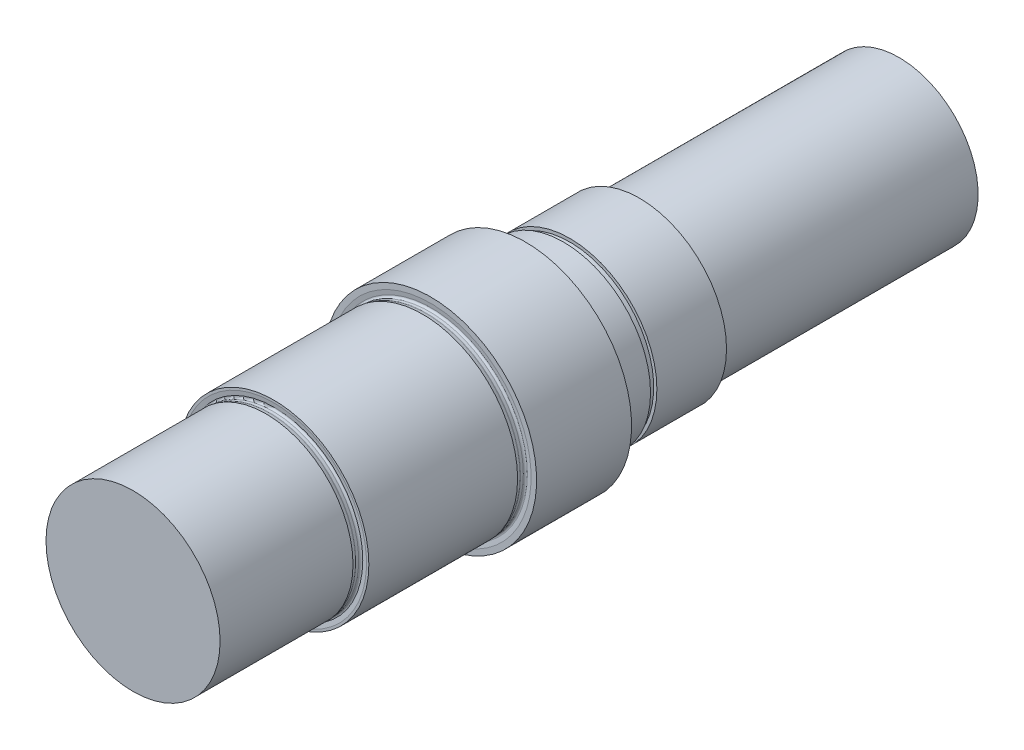
ISO-10303-21;
HEADER;
FILE_DESCRIPTION(('STEP AP214'),'2;1');
FILE_NAME('part.step','',(''),(''),'','','');
FILE_SCHEMA(('AUTOMOTIVE_DESIGN { 1 0 10303 214 1 1 1 1 }'));
ENDSEC;
DATA;
#1=APPLICATION_CONTEXT('core data for automotive mechanical design processes');
#2=APPLICATION_PROTOCOL_DEFINITION('international standard','automotive_design',2000,#1);
#3=PRODUCT_CONTEXT('',#1,'mechanical');
#4=PRODUCT('Part','Part','',(#3));
#5=PRODUCT_RELATED_PRODUCT_CATEGORY('part','',(#4));
#6=PRODUCT_DEFINITION_FORMATION('','',#4);
#7=PRODUCT_DEFINITION_CONTEXT('part definition',#1,'design');
#8=PRODUCT_DEFINITION('design','',#6,#7);
#9=PRODUCT_DEFINITION_SHAPE('','',#8);
#10=(LENGTH_UNIT() NAMED_UNIT(*) SI_UNIT(.MILLI.,.METRE.));
#11=(NAMED_UNIT(*) PLANE_ANGLE_UNIT() SI_UNIT($,.RADIAN.));
#12=(NAMED_UNIT(*) SI_UNIT($,.STERADIAN.) SOLID_ANGLE_UNIT());
#13=UNCERTAINTY_MEASURE_WITH_UNIT(LENGTH_MEASURE(1.E-05),#10,'distance_accuracy_value','');
#14=(GEOMETRIC_REPRESENTATION_CONTEXT(3) GLOBAL_UNCERTAINTY_ASSIGNED_CONTEXT((#13)) GLOBAL_UNIT_ASSIGNED_CONTEXT((#10,
#11,#12)) REPRESENTATION_CONTEXT('',''));
#15=CARTESIAN_POINT('',(0.,0.,0.));
#16=DIRECTION('',(0.,0.,1.));
#17=DIRECTION('',(1.,0.,0.));
#18=AXIS2_PLACEMENT_3D('',#15,#16,#17);
#19=CARTESIAN_POINT('',(0.,0.,-88.99));
#20=DIRECTION('',(0.,0.,-1.));
#21=DIRECTION('',(-1.,0.,0.));
#22=AXIS2_PLACEMENT_3D('',#19,#20,#21);
#23=CYLINDRICAL_SURFACE('',#22,27.5);
#24=CARTESIAN_POINT('',(0.,0.,-136.));
#25=DIRECTION('',(0.,0.,-1.));
#26=DIRECTION('',(-1.,0.,0.));
#27=AXIS2_PLACEMENT_3D('',#24,#25,#26);
#28=CIRCLE('',#27,27.5);
#29=CARTESIAN_POINT('',(-27.5,0.,-136.));
#30=VERTEX_POINT('',#29);
#31=EDGE_CURVE('E134',#30,#30,#28,.T.);
#32=ORIENTED_EDGE('',*,*,#31,.F.);
#33=EDGE_LOOP('',(#32));
#34=FACE_BOUND('',#33,.T.);
#35=CARTESIAN_POINT('',(0.,0.,-126.5));
#36=DIRECTION('',(0.,0.,-1.));
#37=DIRECTION('',(-1.,0.,0.));
#38=AXIS2_PLACEMENT_3D('',#35,#36,#37);
#39=CIRCLE('',#38,27.5);
#40=CARTESIAN_POINT('',(-27.5,0.,-126.5));
#41=VERTEX_POINT('',#40);
#42=EDGE_CURVE('E122',#41,#41,#39,.T.);
#43=ORIENTED_EDGE('',*,*,#42,.T.);
#44=EDGE_LOOP('',(#43));
#45=FACE_BOUND('',#44,.T.);
#46=ADVANCED_FACE('F35',(#34,#45),#23,.T.);
#47=CARTESIAN_POINT('',(0.,30.,-44.5));
#48=DIRECTION('',(0.,0.,1.));
#49=DIRECTION('',(1.,0.,0.));
#50=AXIS2_PLACEMENT_3D('',#47,#48,#49);
#51=PLANE('',#50);
#52=CARTESIAN_POINT('',(0.,0.,-44.5));
#53=DIRECTION('',(0.,0.,-1.));
#54=DIRECTION('',(-1.,0.,0.));
#55=AXIS2_PLACEMENT_3D('',#52,#53,#54);
#56=CIRCLE('',#55,29.2650300316432);
#57=CARTESIAN_POINT('',(-29.2650300316432,0.,-44.5));
#58=VERTEX_POINT('',#57);
#59=EDGE_CURVE('E66',#58,#58,#56,.T.);
#60=ORIENTED_EDGE('',*,*,#59,.T.);
#61=EDGE_LOOP('',(#60));
#62=FACE_BOUND('',#61,.T.);
#63=CARTESIAN_POINT('',(0.,0.,-44.5));
#64=DIRECTION('',(0.,0.,-1.));
#65=DIRECTION('',(-1.,0.,0.));
#66=AXIS2_PLACEMENT_3D('',#63,#64,#65);
#67=CIRCLE('',#66,30.);
#68=CARTESIAN_POINT('',(-30.,0.,-44.5));
#69=VERTEX_POINT('',#68);
#70=EDGE_CURVE('E42',#69,#69,#67,.T.);
#71=ORIENTED_EDGE('',*,*,#70,.F.);
#72=EDGE_LOOP('',(#71));
#73=FACE_BOUND('',#72,.T.);
#74=ADVANCED_FACE('F142',(#62,#73),#51,.T.);
#75=CARTESIAN_POINT('',(0.,0.,-88.99));
#76=DIRECTION('',(0.,0.,-1.));
#77=DIRECTION('',(-1.,0.,0.));
#78=AXIS2_PLACEMENT_3D('',#75,#76,#77);
#79=CYLINDRICAL_SURFACE('',#78,30.);
#80=CARTESIAN_POINT('',(0.,0.,-91.5));
#81=DIRECTION('',(0.,0.,-1.));
#82=DIRECTION('',(-1.,0.,0.));
#83=AXIS2_PLACEMENT_3D('',#80,#81,#82);
#84=CIRCLE('',#83,30.);
#85=CARTESIAN_POINT('',(-30.,0.,-91.5));
#86=VERTEX_POINT('',#85);
#87=EDGE_CURVE('E104',#86,#86,#84,.T.);
#88=ORIENTED_EDGE('',*,*,#87,.F.);
#89=EDGE_LOOP('',(#88));
#90=FACE_BOUND('',#89,.T.);
#91=ORIENTED_EDGE('',*,*,#70,.T.);
#92=EDGE_LOOP('',(#91));
#93=FACE_BOUND('',#92,.T.);
#94=ADVANCED_FACE('F217',(#90,#93),#79,.T.);
#95=CARTESIAN_POINT('',(0.,0.,-44.6941608412449));
#96=DIRECTION('',(0.,0.,1.));
#97=DIRECTION('',(1.,0.,0.));
#98=AXIS2_PLACEMENT_3D('',#95,#96,#97);
#99=CONICAL_SURFACE('',#98,27.883503860576,1.43116998663538);
#100=ORIENTED_EDGE('',*,*,#59,.F.);
#101=EDGE_LOOP('',(#100));
#102=FACE_BOUND('',#101,.T.);
#103=CARTESIAN_POINT('',(0.,0.,-44.6941608412449));
#104=DIRECTION('',(0.,0.,-1.));
#105=DIRECTION('',(-1.,0.,0.));
#106=AXIS2_PLACEMENT_3D('',#103,#104,#105);
#107=CIRCLE('',#106,27.883503860576);
#108=CARTESIAN_POINT('',(-27.883503860576,0.,-44.6941608412449));
#109=VERTEX_POINT('',#108);
#110=EDGE_CURVE('E70',#109,#109,#107,.T.);
#111=ORIENTED_EDGE('',*,*,#110,.T.);
#112=EDGE_LOOP('',(#111));
#113=FACE_BOUND('',#112,.T.);
#114=ADVANCED_FACE('F213',(#102,#113),#99,.F.);
#115=CARTESIAN_POINT('',(0.,0.,-44.1));
#116=DIRECTION('',(0.,0.,-1.));
#117=DIRECTION('',(-1.,0.,0.));
#118=AXIS2_PLACEMENT_3D('',#115,#116,#117);
#119=TOROIDAL_SURFACE('',#118,27.8,0.600000000000002);
#120=ORIENTED_EDGE('',*,*,#110,.F.);
#121=EDGE_LOOP('',(#120));
#122=FACE_BOUND('',#121,.T.);
#123=CARTESIAN_POINT('',(0.,0.,-44.1));
#124=DIRECTION('',(0.,0.,-1.));
#125=DIRECTION('',(-1.,0.,0.));
#126=AXIS2_PLACEMENT_3D('',#123,#124,#125);
#127=CIRCLE('',#126,27.2);
#128=CARTESIAN_POINT('',(-27.2,0.,-44.1));
#129=VERTEX_POINT('',#128);
#130=EDGE_CURVE('E74',#129,#129,#127,.T.);
#131=ORIENTED_EDGE('',*,*,#130,.T.);
#132=EDGE_LOOP('',(#131));
#133=FACE_BOUND('',#132,.T.);
#134=ADVANCED_FACE('F209',(#122,#133),#119,.F.);
#135=CARTESIAN_POINT('',(0.,0.,-88.99));
#136=DIRECTION('',(0.,0.,-1.));
#137=DIRECTION('',(-1.,0.,0.));
#138=AXIS2_PLACEMENT_3D('',#135,#136,#137);
#139=CYLINDRICAL_SURFACE('',#138,27.2);
#140=ORIENTED_EDGE('',*,*,#130,.F.);
#141=EDGE_LOOP('',(#140));
#142=FACE_BOUND('',#141,.T.);
#143=CARTESIAN_POINT('',(0.,0.,-43.1986067408231));
#144=DIRECTION('',(0.,0.,-1.));
#145=DIRECTION('',(-1.,0.,0.));
#146=AXIS2_PLACEMENT_3D('',#143,#144,#145);
#147=CIRCLE('',#146,27.2);
#148=CARTESIAN_POINT('',(-27.2,0.,-43.1986067408231));
#149=VERTEX_POINT('',#148);
#150=EDGE_CURVE('E78',#149,#149,#147,.T.);
#151=ORIENTED_EDGE('',*,*,#150,.T.);
#152=EDGE_LOOP('',(#151));
#153=FACE_BOUND('',#152,.T.);
#154=ADVANCED_FACE('F205',(#142,#153),#139,.T.);
#155=CARTESIAN_POINT('',(0.,0.,-43.1986067408231));
#156=DIRECTION('',(0.,0.,-1.));
#157=DIRECTION('',(-1.,0.,0.));
#158=AXIS2_PLACEMENT_3D('',#155,#156,#157);
#159=TOROIDAL_SURFACE('',#158,27.8,0.600000000000001);
#160=ORIENTED_EDGE('',*,*,#150,.F.);
#161=EDGE_LOOP('',(#160));
#162=FACE_BOUND('',#161,.T.);
#163=CARTESIAN_POINT('',(0.,0.,-43.0433153137616));
#164=DIRECTION('',(0.,0.,-1.));
#165=DIRECTION('',(-1.,0.,0.));
#166=AXIS2_PLACEMENT_3D('',#163,#164,#165);
#167=CIRCLE('',#166,27.2204445042266);
#168=CARTESIAN_POINT('',(-27.2204445042266,0.,-43.0433153137616));
#169=VERTEX_POINT('',#168);
#170=EDGE_CURVE('E82',#169,#169,#167,.T.);
#171=ORIENTED_EDGE('',*,*,#170,.T.);
#172=EDGE_LOOP('',(#171));
#173=FACE_BOUND('',#172,.T.);
#174=ADVANCED_FACE('F201',(#162,#173),#159,.F.);
#175=CARTESIAN_POINT('',(0.,0.,-42.));
#176=DIRECTION('',(0.,0.,1.));
#177=DIRECTION('',(1.,0.,0.));
#178=AXIS2_PLACEMENT_3D('',#175,#176,#177);
#179=CONICAL_SURFACE('',#178,27.5,0.26179938779915);
#180=ORIENTED_EDGE('',*,*,#170,.F.);
#181=EDGE_LOOP('',(#180));
#182=FACE_BOUND('',#181,.T.);
#183=CARTESIAN_POINT('',(0.,0.,-42.));
#184=DIRECTION('',(0.,0.,-1.));
#185=DIRECTION('',(-1.,0.,0.));
#186=AXIS2_PLACEMENT_3D('',#183,#184,#185);
#187=CIRCLE('',#186,27.5);
#188=CARTESIAN_POINT('',(-27.5,0.,-42.));
#189=VERTEX_POINT('',#188);
#190=EDGE_CURVE('E86',#189,#189,#187,.T.);
#191=ORIENTED_EDGE('',*,*,#190,.T.);
#192=EDGE_LOOP('',(#191));
#193=FACE_BOUND('',#192,.T.);
#194=ADVANCED_FACE('F198',(#182,#193),#179,.T.);
#195=CARTESIAN_POINT('',(0.,0.,0.));
#196=DIRECTION('',(0.,0.,1.));
#197=DIRECTION('',(1.,0.,0.));
#198=AXIS2_PLACEMENT_3D('',#195,#196,#197);
#199=PLANE('',#198);
#200=CARTESIAN_POINT('',(0.,0.,0.));
#201=DIRECTION('',(0.,0.,-1.));
#202=DIRECTION('',(-1.,0.,0.));
#203=AXIS2_PLACEMENT_3D('',#200,#201,#202);
#204=CIRCLE('',#203,27.5);
#205=CARTESIAN_POINT('',(-27.5,0.,0.));
#206=VERTEX_POINT('',#205);
#207=EDGE_CURVE('E10',#206,#206,#204,.T.);
#208=ORIENTED_EDGE('',*,*,#207,.F.);
#209=EDGE_LOOP('',(#208));
#210=FACE_BOUND('',#209,.T.);
#211=ADVANCED_FACE('F37',(#210),#199,.T.);
#212=CARTESIAN_POINT('',(0.,0.,-88.99));
#213=DIRECTION('',(0.,0.,-1.));
#214=DIRECTION('',(-1.,0.,0.));
#215=AXIS2_PLACEMENT_3D('',#212,#213,#214);
#216=CYLINDRICAL_SURFACE('',#215,27.5);
#217=ORIENTED_EDGE('',*,*,#190,.F.);
#218=EDGE_LOOP('',(#217));
#219=FACE_BOUND('',#218,.T.);
#220=ORIENTED_EDGE('',*,*,#207,.T.);
#221=EDGE_LOOP('',(#220));
#222=FACE_BOUND('',#221,.T.);
#223=ADVANCED_FACE('F196',(#219,#222),#216,.T.);
#224=CARTESIAN_POINT('',(0.,0.,-94.1941608412449));
#225=DIRECTION('',(0.,0.,1.));
#226=DIRECTION('',(1.,0.,0.));
#227=AXIS2_PLACEMENT_3D('',#224,#225,#226);
#228=CONICAL_SURFACE('',#227,30.383503860576,1.43116998663538);
#229=CARTESIAN_POINT('',(0.,0.,-94.));
#230=DIRECTION('',(0.,0.,-1.));
#231=DIRECTION('',(-1.,0.,0.));
#232=AXIS2_PLACEMENT_3D('',#229,#230,#231);
#233=CIRCLE('',#232,31.7650300316432);
#234=CARTESIAN_POINT('',(-31.7650300316432,0.,-94.));
#235=VERTEX_POINT('',#234);
#236=EDGE_CURVE('E89',#235,#235,#233,.T.);
#237=ORIENTED_EDGE('',*,*,#236,.F.);
#238=EDGE_LOOP('',(#237));
#239=FACE_BOUND('',#238,.T.);
#240=CARTESIAN_POINT('',(0.,0.,-94.1941608412449));
#241=DIRECTION('',(0.,0.,-1.));
#242=DIRECTION('',(-1.,0.,0.));
#243=AXIS2_PLACEMENT_3D('',#240,#241,#242);
#244=CIRCLE('',#243,30.383503860576);
#245=CARTESIAN_POINT('',(-30.383503860576,0.,-94.1941608412449));
#246=VERTEX_POINT('',#245);
#247=EDGE_CURVE('E92',#246,#246,#244,.T.);
#248=ORIENTED_EDGE('',*,*,#247,.T.);
#249=EDGE_LOOP('',(#248));
#250=FACE_BOUND('',#249,.T.);
#251=ADVANCED_FACE('F192',(#239,#250),#228,.F.);
#252=CARTESIAN_POINT('',(0.,0.,-93.6));
#253=DIRECTION('',(0.,0.,-1.));
#254=DIRECTION('',(-1.,0.,0.));
#255=AXIS2_PLACEMENT_3D('',#252,#253,#254);
#256=TOROIDAL_SURFACE('',#255,30.3,0.599999999999998);
#257=ORIENTED_EDGE('',*,*,#247,.F.);
#258=EDGE_LOOP('',(#257));
#259=FACE_BOUND('',#258,.T.);
#260=CARTESIAN_POINT('',(0.,0.,-93.6));
#261=DIRECTION('',(0.,0.,-1.));
#262=DIRECTION('',(-1.,0.,0.));
#263=AXIS2_PLACEMENT_3D('',#260,#261,#262);
#264=CIRCLE('',#263,29.7);
#265=CARTESIAN_POINT('',(-29.7,0.,-93.6));
#266=VERTEX_POINT('',#265);
#267=EDGE_CURVE('E95',#266,#266,#264,.T.);
#268=ORIENTED_EDGE('',*,*,#267,.T.);
#269=EDGE_LOOP('',(#268));
#270=FACE_BOUND('',#269,.T.);
#271=ADVANCED_FACE('F188',(#259,#270),#256,.F.);
#272=CARTESIAN_POINT('',(0.,0.,-88.99));
#273=DIRECTION('',(0.,0.,-1.));
#274=DIRECTION('',(-1.,0.,0.));
#275=AXIS2_PLACEMENT_3D('',#272,#273,#274);
#276=CYLINDRICAL_SURFACE('',#275,29.7);
#277=ORIENTED_EDGE('',*,*,#267,.F.);
#278=EDGE_LOOP('',(#277));
#279=FACE_BOUND('',#278,.T.);
#280=CARTESIAN_POINT('',(0.,0.,-92.6986067408231));
#281=DIRECTION('',(0.,0.,-1.));
#282=DIRECTION('',(-1.,0.,0.));
#283=AXIS2_PLACEMENT_3D('',#280,#281,#282);
#284=CIRCLE('',#283,29.7);
#285=CARTESIAN_POINT('',(-29.7,0.,-92.6986067408231));
#286=VERTEX_POINT('',#285);
#287=EDGE_CURVE('E98',#286,#286,#284,.T.);
#288=ORIENTED_EDGE('',*,*,#287,.T.);
#289=EDGE_LOOP('',(#288));
#290=FACE_BOUND('',#289,.T.);
#291=ADVANCED_FACE('F184',(#279,#290),#276,.T.);
#292=CARTESIAN_POINT('',(0.,0.,-92.6986067408231));
#293=DIRECTION('',(0.,0.,-1.));
#294=DIRECTION('',(-1.,0.,0.));
#295=AXIS2_PLACEMENT_3D('',#292,#293,#294);
#296=TOROIDAL_SURFACE('',#295,30.3,0.599999999999999);
#297=ORIENTED_EDGE('',*,*,#287,.F.);
#298=EDGE_LOOP('',(#297));
#299=FACE_BOUND('',#298,.T.);
#300=CARTESIAN_POINT('',(0.,0.,-92.5433153137616));
#301=DIRECTION('',(0.,0.,-1.));
#302=DIRECTION('',(-1.,0.,0.));
#303=AXIS2_PLACEMENT_3D('',#300,#301,#302);
#304=CIRCLE('',#303,29.7204445042266);
#305=CARTESIAN_POINT('',(-29.7204445042266,0.,-92.5433153137616));
#306=VERTEX_POINT('',#305);
#307=EDGE_CURVE('E101',#306,#306,#304,.T.);
#308=ORIENTED_EDGE('',*,*,#307,.T.);
#309=EDGE_LOOP('',(#308));
#310=FACE_BOUND('',#309,.T.);
#311=ADVANCED_FACE('F180',(#299,#310),#296,.F.);
#312=CARTESIAN_POINT('',(0.,0.,-91.5));
#313=DIRECTION('',(0.,0.,1.));
#314=DIRECTION('',(1.,0.,0.));
#315=AXIS2_PLACEMENT_3D('',#312,#313,#314);
#316=CONICAL_SURFACE('',#315,30.,0.261799387799149);
#317=ORIENTED_EDGE('',*,*,#307,.F.);
#318=EDGE_LOOP('',(#317));
#319=FACE_BOUND('',#318,.T.);
#320=ORIENTED_EDGE('',*,*,#87,.T.);
#321=EDGE_LOOP('',(#320));
#322=FACE_BOUND('',#321,.T.);
#323=ADVANCED_FACE('F176',(#319,#322),#316,.T.);
#324=CARTESIAN_POINT('',(0.,33.5,-124.));
#325=DIRECTION('',(0.,0.,-1.));
#326=DIRECTION('',(-1.,0.,0.));
#327=AXIS2_PLACEMENT_3D('',#324,#325,#326);
#328=PLANE('',#327);
#329=CARTESIAN_POINT('',(0.,0.,-124.));
#330=DIRECTION('',(0.,0.,-1.));
#331=DIRECTION('',(-1.,0.,0.));
#332=AXIS2_PLACEMENT_3D('',#329,#330,#331);
#333=CIRCLE('',#332,29.2650300316432);
#334=CARTESIAN_POINT('',(-29.2650300316432,0.,-124.));
#335=VERTEX_POINT('',#334);
#336=EDGE_CURVE('E107',#335,#335,#333,.T.);
#337=ORIENTED_EDGE('',*,*,#336,.F.);
#338=EDGE_LOOP('',(#337));
#339=FACE_BOUND('',#338,.T.);
#340=CARTESIAN_POINT('',(0.,0.,-124.));
#341=DIRECTION('',(0.,0.,-1.));
#342=DIRECTION('',(-1.,0.,0.));
#343=AXIS2_PLACEMENT_3D('',#340,#341,#342);
#344=CIRCLE('',#343,33.5);
#345=CARTESIAN_POINT('',(-33.5,0.,-124.));
#346=VERTEX_POINT('',#345);
#347=EDGE_CURVE('E52',#346,#346,#344,.T.);
#348=ORIENTED_EDGE('',*,*,#347,.T.);
#349=EDGE_LOOP('',(#348));
#350=FACE_BOUND('',#349,.T.);
#351=ADVANCED_FACE('F179',(#339,#350),#328,.T.);
#352=CARTESIAN_POINT('',(0.,0.,-88.99));
#353=DIRECTION('',(0.,0.,-1.));
#354=DIRECTION('',(-1.,0.,0.));
#355=AXIS2_PLACEMENT_3D('',#352,#353,#354);
#356=CYLINDRICAL_SURFACE('',#355,33.5);
#357=CARTESIAN_POINT('',(0.,0.,-94.));
#358=DIRECTION('',(0.,0.,-1.));
#359=DIRECTION('',(-1.,0.,0.));
#360=AXIS2_PLACEMENT_3D('',#357,#358,#359);
#361=CIRCLE('',#360,33.5);
#362=CARTESIAN_POINT('',(-33.5,0.,-94.));
#363=VERTEX_POINT('',#362);
#364=EDGE_CURVE('E47',#363,#363,#361,.T.);
#365=ORIENTED_EDGE('',*,*,#364,.T.);
#366=EDGE_LOOP('',(#365));
#367=FACE_BOUND('',#366,.T.);
#368=ORIENTED_EDGE('',*,*,#347,.F.);
#369=EDGE_LOOP('',(#368));
#370=FACE_BOUND('',#369,.T.);
#371=ADVANCED_FACE('F236',(#367,#370),#356,.T.);
#372=CARTESIAN_POINT('',(0.,30.,-94.));
#373=DIRECTION('',(0.,0.,1.));
#374=DIRECTION('',(1.,0.,0.));
#375=AXIS2_PLACEMENT_3D('',#372,#373,#374);
#376=PLANE('',#375);
#377=ORIENTED_EDGE('',*,*,#236,.T.);
#378=EDGE_LOOP('',(#377));
#379=FACE_BOUND('',#378,.T.);
#380=ORIENTED_EDGE('',*,*,#364,.F.);
#381=EDGE_LOOP('',(#380));
#382=FACE_BOUND('',#381,.T.);
#383=ADVANCED_FACE('F174',(#379,#382),#376,.T.);
#384=CARTESIAN_POINT('',(0.,0.,-123.805839158755));
#385=DIRECTION('',(0.,0.,-1.));
#386=DIRECTION('',(-1.,0.,0.));
#387=AXIS2_PLACEMENT_3D('',#384,#385,#386);
#388=CONICAL_SURFACE('',#387,27.883503860576,1.43116998663538);
#389=ORIENTED_EDGE('',*,*,#336,.T.);
#390=EDGE_LOOP('',(#389));
#391=FACE_BOUND('',#390,.T.);
#392=CARTESIAN_POINT('',(0.,0.,-123.805839158755));
#393=DIRECTION('',(0.,0.,-1.));
#394=DIRECTION('',(-1.,0.,0.));
#395=AXIS2_PLACEMENT_3D('',#392,#393,#394);
#396=CIRCLE('',#395,27.883503860576);
#397=CARTESIAN_POINT('',(-27.883503860576,0.,-123.805839158755));
#398=VERTEX_POINT('',#397);
#399=EDGE_CURVE('E110',#398,#398,#396,.T.);
#400=ORIENTED_EDGE('',*,*,#399,.F.);
#401=EDGE_LOOP('',(#400));
#402=FACE_BOUND('',#401,.T.);
#403=ADVANCED_FACE('F170',(#391,#402),#388,.F.);
#404=CARTESIAN_POINT('',(0.,0.,-124.4));
#405=DIRECTION('',(0.,0.,-1.));
#406=DIRECTION('',(-1.,0.,0.));
#407=AXIS2_PLACEMENT_3D('',#404,#405,#406);
#408=TOROIDAL_SURFACE('',#407,27.8,0.599999999999998);
#409=ORIENTED_EDGE('',*,*,#399,.T.);
#410=EDGE_LOOP('',(#409));
#411=FACE_BOUND('',#410,.T.);
#412=CARTESIAN_POINT('',(0.,0.,-124.4));
#413=DIRECTION('',(0.,0.,-1.));
#414=DIRECTION('',(-1.,0.,0.));
#415=AXIS2_PLACEMENT_3D('',#412,#413,#414);
#416=CIRCLE('',#415,27.2);
#417=CARTESIAN_POINT('',(-27.2,0.,-124.4));
#418=VERTEX_POINT('',#417);
#419=EDGE_CURVE('E113',#418,#418,#416,.T.);
#420=ORIENTED_EDGE('',*,*,#419,.F.);
#421=EDGE_LOOP('',(#420));
#422=FACE_BOUND('',#421,.T.);
#423=ADVANCED_FACE('F166',(#411,#422),#408,.F.);
#424=CARTESIAN_POINT('',(0.,0.,-88.99));
#425=DIRECTION('',(0.,0.,-1.));
#426=DIRECTION('',(-1.,0.,0.));
#427=AXIS2_PLACEMENT_3D('',#424,#425,#426);
#428=CYLINDRICAL_SURFACE('',#427,27.2);
#429=ORIENTED_EDGE('',*,*,#419,.T.);
#430=EDGE_LOOP('',(#429));
#431=FACE_BOUND('',#430,.T.);
#432=CARTESIAN_POINT('',(0.,0.,-125.301393259177));
#433=DIRECTION('',(0.,0.,-1.));
#434=DIRECTION('',(-1.,0.,0.));
#435=AXIS2_PLACEMENT_3D('',#432,#433,#434);
#436=CIRCLE('',#435,27.2);
#437=CARTESIAN_POINT('',(-27.2,0.,-125.301393259177));
#438=VERTEX_POINT('',#437);
#439=EDGE_CURVE('E116',#438,#438,#436,.T.);
#440=ORIENTED_EDGE('',*,*,#439,.F.);
#441=EDGE_LOOP('',(#440));
#442=FACE_BOUND('',#441,.T.);
#443=ADVANCED_FACE('F159',(#431,#442),#428,.T.);
#444=CARTESIAN_POINT('',(0.,0.,-125.301393259177));
#445=DIRECTION('',(0.,0.,-1.));
#446=DIRECTION('',(-1.,0.,0.));
#447=AXIS2_PLACEMENT_3D('',#444,#445,#446);
#448=TOROIDAL_SURFACE('',#447,27.8,0.599999999999999);
#449=ORIENTED_EDGE('',*,*,#439,.T.);
#450=EDGE_LOOP('',(#449));
#451=FACE_BOUND('',#450,.T.);
#452=CARTESIAN_POINT('',(0.,0.,-125.456684686238));
#453=DIRECTION('',(0.,0.,-1.));
#454=DIRECTION('',(-1.,0.,0.));
#455=AXIS2_PLACEMENT_3D('',#452,#453,#454);
#456=CIRCLE('',#455,27.2204445042266);
#457=CARTESIAN_POINT('',(-27.2204445042266,0.,-125.456684686238));
#458=VERTEX_POINT('',#457);
#459=EDGE_CURVE('E119',#458,#458,#456,.T.);
#460=ORIENTED_EDGE('',*,*,#459,.F.);
#461=EDGE_LOOP('',(#460));
#462=FACE_BOUND('',#461,.T.);
#463=ADVANCED_FACE('F149',(#451,#462),#448,.F.);
#464=CARTESIAN_POINT('',(0.,0.,-126.5));
#465=DIRECTION('',(0.,0.,-1.));
#466=DIRECTION('',(-1.,0.,0.));
#467=AXIS2_PLACEMENT_3D('',#464,#465,#466);
#468=CONICAL_SURFACE('',#467,27.5,0.261799387799149);
#469=ORIENTED_EDGE('',*,*,#459,.T.);
#470=EDGE_LOOP('',(#469));
#471=FACE_BOUND('',#470,.T.);
#472=ORIENTED_EDGE('',*,*,#42,.F.);
#473=EDGE_LOOP('',(#472));
#474=FACE_BOUND('',#473,.T.);
#475=ADVANCED_FACE('F147',(#471,#474),#468,.T.);
#476=CARTESIAN_POINT('',(0.,27.5,-136.));
#477=DIRECTION('',(0.,0.,1.));
#478=DIRECTION('',(1.,0.,0.));
#479=AXIS2_PLACEMENT_3D('',#476,#477,#478);
#480=PLANE('',#479);
#481=CARTESIAN_POINT('',(0.,0.,-136.));
#482=DIRECTION('',(0.,0.,-1.));
#483=DIRECTION('',(-1.,0.,0.));
#484=AXIS2_PLACEMENT_3D('',#481,#482,#483);
#485=CIRCLE('',#484,26.5);
#486=CARTESIAN_POINT('',(-26.5,0.,-136.));
#487=VERTEX_POINT('',#486);
#488=EDGE_CURVE('E125',#487,#487,#485,.T.);
#489=ORIENTED_EDGE('',*,*,#488,.F.);
#490=EDGE_LOOP('',(#489));
#491=FACE_BOUND('',#490,.T.);
#492=ORIENTED_EDGE('',*,*,#31,.T.);
#493=EDGE_LOOP('',(#492));
#494=FACE_BOUND('',#493,.T.);
#495=ADVANCED_FACE('F138',(#491,#494),#480,.F.);
#496=CARTESIAN_POINT('',(0.,0.,-88.99));
#497=DIRECTION('',(0.,0.,-1.));
#498=DIRECTION('',(-1.,0.,0.));
#499=AXIS2_PLACEMENT_3D('',#496,#497,#498);
#500=CYLINDRICAL_SURFACE('',#499,26.5);
#501=CARTESIAN_POINT('',(0.,0.,-138.));
#502=DIRECTION('',(0.,0.,-1.));
#503=DIRECTION('',(-1.,0.,0.));
#504=AXIS2_PLACEMENT_3D('',#501,#502,#503);
#505=CIRCLE('',#504,26.5);
#506=CARTESIAN_POINT('',(-26.5,0.,-138.));
#507=VERTEX_POINT('',#506);
#508=EDGE_CURVE('E128',#507,#507,#505,.T.);
#509=ORIENTED_EDGE('',*,*,#508,.F.);
#510=EDGE_LOOP('',(#509));
#511=FACE_BOUND('',#510,.T.);
#512=ORIENTED_EDGE('',*,*,#488,.T.);
#513=EDGE_LOOP('',(#512));
#514=FACE_BOUND('',#513,.T.);
#515=ADVANCED_FACE('F156',(#511,#514),#500,.T.);
#516=CARTESIAN_POINT('',(0.,27.5,-138.));
#517=DIRECTION('',(0.,0.,-1.));
#518=DIRECTION('',(-1.,0.,0.));
#519=AXIS2_PLACEMENT_3D('',#516,#517,#518);
#520=PLANE('',#519);
#521=CARTESIAN_POINT('',(0.,0.,-138.));
#522=DIRECTION('',(0.,0.,-1.));
#523=DIRECTION('',(-1.,0.,0.));
#524=AXIS2_PLACEMENT_3D('',#521,#522,#523);
#525=CIRCLE('',#524,27.5);
#526=CARTESIAN_POINT('',(-27.5,0.,-138.));
#527=VERTEX_POINT('',#526);
#528=EDGE_CURVE('E131',#527,#527,#525,.T.);
#529=ORIENTED_EDGE('',*,*,#528,.F.);
#530=EDGE_LOOP('',(#529));
#531=FACE_BOUND('',#530,.T.);
#532=ORIENTED_EDGE('',*,*,#508,.T.);
#533=EDGE_LOOP('',(#532));
#534=FACE_BOUND('',#533,.T.);
#535=ADVANCED_FACE('F223',(#531,#534),#520,.F.);
#536=CARTESIAN_POINT('',(0.,25.,-242.));
#537=DIRECTION('',(0.,0.,-1.));
#538=DIRECTION('',(-1.,0.,0.));
#539=AXIS2_PLACEMENT_3D('',#536,#537,#538);
#540=PLANE('',#539);
#541=CARTESIAN_POINT('',(0.,0.,-242.));
#542=DIRECTION('',(0.,0.,-1.));
#543=DIRECTION('',(-1.,0.,0.));
#544=AXIS2_PLACEMENT_3D('',#541,#542,#543);
#545=CIRCLE('',#544,25.);
#546=CARTESIAN_POINT('',(-25.,0.,-242.));
#547=VERTEX_POINT('',#546);
#548=EDGE_CURVE('E63',#547,#547,#545,.T.);
#549=ORIENTED_EDGE('',*,*,#548,.T.);
#550=EDGE_LOOP('',(#549));
#551=FACE_BOUND('',#550,.T.);
#552=ADVANCED_FACE('F219',(#551),#540,.T.);
#553=CARTESIAN_POINT('',(0.,0.,-88.99));
#554=DIRECTION('',(0.,0.,-1.));
#555=DIRECTION('',(-1.,0.,0.));
#556=AXIS2_PLACEMENT_3D('',#553,#554,#555);
#557=CYLINDRICAL_SURFACE('',#556,25.);
#558=CARTESIAN_POINT('',(0.,0.,-160.));
#559=DIRECTION('',(0.,0.,-1.));
#560=DIRECTION('',(-1.,0.,0.));
#561=AXIS2_PLACEMENT_3D('',#558,#559,#560);
#562=CIRCLE('',#561,25.);
#563=CARTESIAN_POINT('',(-25.,0.,-160.));
#564=VERTEX_POINT('',#563);
#565=EDGE_CURVE('E60',#564,#564,#562,.T.);
#566=ORIENTED_EDGE('',*,*,#565,.T.);
#567=EDGE_LOOP('',(#566));
#568=FACE_BOUND('',#567,.T.);
#569=ORIENTED_EDGE('',*,*,#548,.F.);
#570=EDGE_LOOP('',(#569));
#571=FACE_BOUND('',#570,.T.);
#572=ADVANCED_FACE('F222',(#568,#571),#557,.T.);
#573=CARTESIAN_POINT('',(0.,27.5,-160.));
#574=DIRECTION('',(0.,0.,-1.));
#575=DIRECTION('',(-1.,0.,0.));
#576=AXIS2_PLACEMENT_3D('',#573,#574,#575);
#577=PLANE('',#576);
#578=CARTESIAN_POINT('',(0.,0.,-160.));
#579=DIRECTION('',(0.,0.,-1.));
#580=DIRECTION('',(-1.,0.,0.));
#581=AXIS2_PLACEMENT_3D('',#578,#579,#580);
#582=CIRCLE('',#581,27.5);
#583=CARTESIAN_POINT('',(-27.5,0.,-160.));
#584=VERTEX_POINT('',#583);
#585=EDGE_CURVE('E57',#584,#584,#582,.T.);
#586=ORIENTED_EDGE('',*,*,#585,.T.);
#587=EDGE_LOOP('',(#586));
#588=FACE_BOUND('',#587,.T.);
#589=ORIENTED_EDGE('',*,*,#565,.F.);
#590=EDGE_LOOP('',(#589));
#591=FACE_BOUND('',#590,.T.);
#592=ADVANCED_FACE('F227',(#588,#591),#577,.T.);
#593=ORIENTED_EDGE('',*,*,#528,.T.);
#594=EDGE_LOOP('',(#593));
#595=FACE_BOUND('',#594,.T.);
#596=ORIENTED_EDGE('',*,*,#585,.F.);
#597=EDGE_LOOP('',(#596));
#598=FACE_BOUND('',#597,.T.);
#599=ADVANCED_FACE('F144',(#595,#598),#23,.T.);
#600=CLOSED_SHELL('',(#46,#74,#94,#114,#134,#154,#174,#194,#211,#223,#251,#271,#291,#311,#323,
#351,#371,#383,#403,#423,#443,#463,#475,#495,#515,#535,#552,#572,#592,#599));
#601=MANIFOLD_SOLID_BREP('B2',#600);
#602=ADVANCED_BREP_SHAPE_REPRESENTATION('',(#18,#601),#14);
#603=SHAPE_DEFINITION_REPRESENTATION(#9,#602);
ENDSEC;
END-ISO-10303-21;
